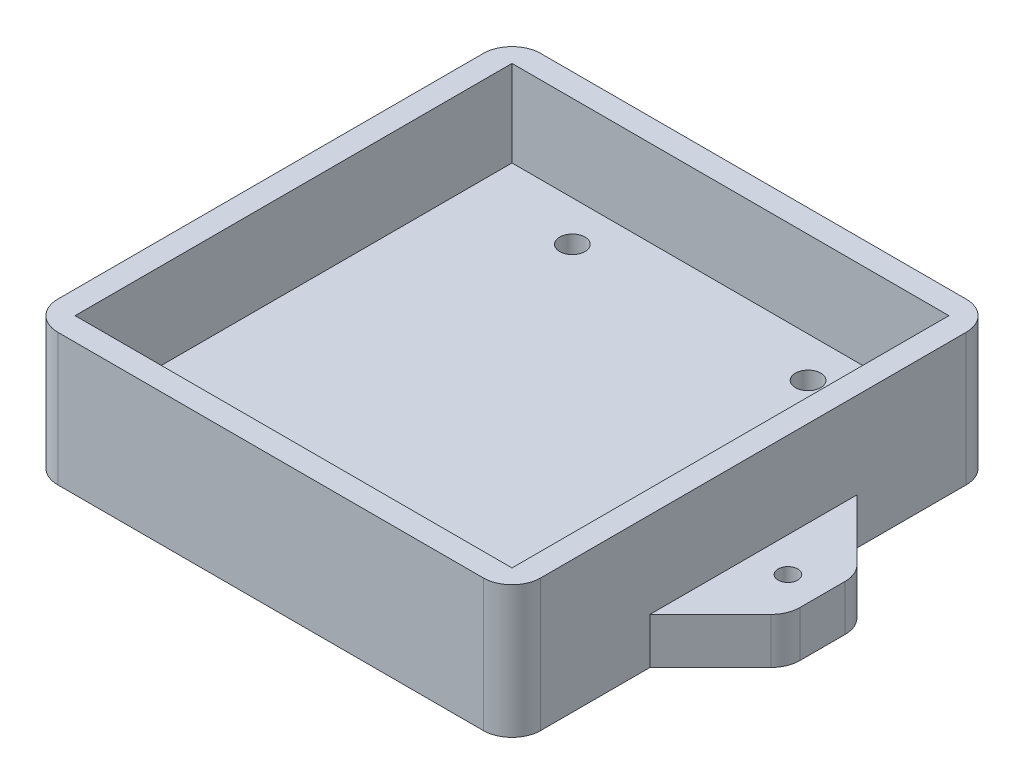
ISO-10303-21;
HEADER;
FILE_DESCRIPTION(('STEP AP214'),'2;1');
FILE_NAME('part.step','',(''),(''),'','','');
FILE_SCHEMA(('AUTOMOTIVE_DESIGN { 1 0 10303 214 1 1 1 1 }'));
ENDSEC;
DATA;
#1=APPLICATION_CONTEXT('core data for automotive mechanical design processes');
#2=APPLICATION_PROTOCOL_DEFINITION('international standard','automotive_design',2000,#1);
#3=PRODUCT_CONTEXT('',#1,'mechanical');
#4=PRODUCT('Part','Part','',(#3));
#5=PRODUCT_RELATED_PRODUCT_CATEGORY('part','',(#4));
#6=PRODUCT_DEFINITION_FORMATION('','',#4);
#7=PRODUCT_DEFINITION_CONTEXT('part definition',#1,'design');
#8=PRODUCT_DEFINITION('design','',#6,#7);
#9=PRODUCT_DEFINITION_SHAPE('','',#8);
#10=(LENGTH_UNIT() NAMED_UNIT(*) SI_UNIT(.MILLI.,.METRE.));
#11=(NAMED_UNIT(*) PLANE_ANGLE_UNIT() SI_UNIT($,.RADIAN.));
#12=(NAMED_UNIT(*) SI_UNIT($,.STERADIAN.) SOLID_ANGLE_UNIT());
#13=UNCERTAINTY_MEASURE_WITH_UNIT(LENGTH_MEASURE(1.E-05),#10,'distance_accuracy_value','');
#14=(GEOMETRIC_REPRESENTATION_CONTEXT(3) GLOBAL_UNCERTAINTY_ASSIGNED_CONTEXT((#13)) GLOBAL_UNIT_ASSIGNED_CONTEXT((#10,
#11,#12)) REPRESENTATION_CONTEXT('',''));
#15=CARTESIAN_POINT('',(0.,0.,0.));
#16=DIRECTION('',(0.,0.,1.));
#17=DIRECTION('',(1.,0.,0.));
#18=AXIS2_PLACEMENT_3D('',#15,#16,#17);
#19=CARTESIAN_POINT('',(-20.5,-8.,31.));
#20=DIRECTION('',(0.,1.,0.));
#21=DIRECTION('',(0.,0.,1.));
#22=AXIS2_PLACEMENT_3D('',#19,#20,#21);
#23=CYLINDRICAL_SURFACE('',#22,2.2);
#24=CARTESIAN_POINT('',(-20.5,0.,31.));
#25=DIRECTION('',(0.,1.,0.));
#26=DIRECTION('',(0.,0.,1.));
#27=AXIS2_PLACEMENT_3D('',#24,#25,#26);
#28=CIRCLE('',#27,2.2);
#29=CARTESIAN_POINT('',(-20.5,0.,33.2));
#30=VERTEX_POINT('',#29);
#31=EDGE_CURVE('E374',#30,#30,#28,.T.);
#32=ORIENTED_EDGE('',*,*,#31,.T.);
#33=EDGE_LOOP('',(#32));
#34=FACE_BOUND('',#33,.T.);
#35=CARTESIAN_POINT('',(-20.5,-3.5,31.));
#36=DIRECTION('',(0.,-1.,0.));
#37=DIRECTION('',(0.,0.,-1.));
#38=AXIS2_PLACEMENT_3D('',#35,#36,#37);
#39=CIRCLE('',#38,2.2);
#40=CARTESIAN_POINT('',(-20.5,-3.5,28.8));
#41=VERTEX_POINT('',#40);
#42=EDGE_CURVE('E265',#41,#41,#39,.F.);
#43=ORIENTED_EDGE('',*,*,#42,.F.);
#44=EDGE_LOOP('',(#43));
#45=FACE_BOUND('',#44,.T.);
#46=ADVANCED_FACE('F47',(#34,#45),#23,.F.);
#47=CARTESIAN_POINT('',(20.5,-8.,-31.));
#48=DIRECTION('',(0.,1.,0.));
#49=DIRECTION('',(0.,0.,1.));
#50=AXIS2_PLACEMENT_3D('',#47,#48,#49);
#51=CYLINDRICAL_SURFACE('',#50,2.2);
#52=CARTESIAN_POINT('',(20.5,0.,-31.));
#53=DIRECTION('',(0.,1.,0.));
#54=DIRECTION('',(0.,0.,1.));
#55=AXIS2_PLACEMENT_3D('',#52,#53,#54);
#56=CIRCLE('',#55,2.2);
#57=CARTESIAN_POINT('',(20.5,0.,-28.8));
#58=VERTEX_POINT('',#57);
#59=EDGE_CURVE('E370',#58,#58,#56,.T.);
#60=ORIENTED_EDGE('',*,*,#59,.T.);
#61=EDGE_LOOP('',(#60));
#62=FACE_BOUND('',#61,.T.);
#63=CARTESIAN_POINT('',(20.5,-3.5,-31.));
#64=DIRECTION('',(0.,-1.,0.));
#65=DIRECTION('',(0.,0.,-1.));
#66=AXIS2_PLACEMENT_3D('',#63,#64,#65);
#67=CIRCLE('',#66,2.2);
#68=CARTESIAN_POINT('',(20.5,-3.5,-33.2));
#69=VERTEX_POINT('',#68);
#70=EDGE_CURVE('E404',#69,#69,#67,.F.);
#71=ORIENTED_EDGE('',*,*,#70,.F.);
#72=EDGE_LOOP('',(#71));
#73=FACE_BOUND('',#72,.T.);
#74=ADVANCED_FACE('F612',(#62,#73),#51,.F.);
#75=CARTESIAN_POINT('',(-20.5,-8.,-31.));
#76=DIRECTION('',(0.,1.,0.));
#77=DIRECTION('',(0.,0.,1.));
#78=AXIS2_PLACEMENT_3D('',#75,#76,#77);
#79=CYLINDRICAL_SURFACE('',#78,2.2);
#80=CARTESIAN_POINT('',(-20.5,0.,-31.));
#81=DIRECTION('',(0.,1.,0.));
#82=DIRECTION('',(0.,0.,1.));
#83=AXIS2_PLACEMENT_3D('',#80,#81,#82);
#84=CIRCLE('',#83,2.2);
#85=CARTESIAN_POINT('',(-20.5,0.,-28.8));
#86=VERTEX_POINT('',#85);
#87=EDGE_CURVE('E366',#86,#86,#84,.T.);
#88=ORIENTED_EDGE('',*,*,#87,.T.);
#89=EDGE_LOOP('',(#88));
#90=FACE_BOUND('',#89,.T.);
#91=CARTESIAN_POINT('',(-20.5,-3.5,-31.));
#92=DIRECTION('',(0.,-1.,0.));
#93=DIRECTION('',(0.,0.,-1.));
#94=AXIS2_PLACEMENT_3D('',#91,#92,#93);
#95=CIRCLE('',#94,2.2);
#96=CARTESIAN_POINT('',(-20.5,-3.5,-33.2));
#97=VERTEX_POINT('',#96);
#98=EDGE_CURVE('E399',#97,#97,#95,.F.);
#99=ORIENTED_EDGE('',*,*,#98,.F.);
#100=EDGE_LOOP('',(#99));
#101=FACE_BOUND('',#100,.T.);
#102=ADVANCED_FACE('F619',(#90,#101),#79,.F.);
#103=CARTESIAN_POINT('',(20.5,-8.,31.));
#104=DIRECTION('',(0.,1.,0.));
#105=DIRECTION('',(0.,0.,1.));
#106=AXIS2_PLACEMENT_3D('',#103,#104,#105);
#107=CYLINDRICAL_SURFACE('',#106,2.2);
#108=CARTESIAN_POINT('',(20.5,0.,31.));
#109=DIRECTION('',(0.,1.,0.));
#110=DIRECTION('',(0.,0.,1.));
#111=AXIS2_PLACEMENT_3D('',#108,#109,#110);
#112=CIRCLE('',#111,2.2);
#113=CARTESIAN_POINT('',(20.5,0.,33.2));
#114=VERTEX_POINT('',#113);
#115=EDGE_CURVE('E296',#114,#114,#112,.T.);
#116=ORIENTED_EDGE('',*,*,#115,.T.);
#117=EDGE_LOOP('',(#116));
#118=FACE_BOUND('',#117,.T.);
#119=CARTESIAN_POINT('',(20.5,-3.5,31.));
#120=DIRECTION('',(0.,-1.,0.));
#121=DIRECTION('',(0.,0.,-1.));
#122=AXIS2_PLACEMENT_3D('',#119,#120,#121);
#123=CIRCLE('',#122,2.2);
#124=CARTESIAN_POINT('',(20.5,-3.5,28.8));
#125=VERTEX_POINT('',#124);
#126=EDGE_CURVE('E395',#125,#125,#123,.F.);
#127=ORIENTED_EDGE('',*,*,#126,.F.);
#128=EDGE_LOOP('',(#127));
#129=FACE_BOUND('',#128,.T.);
#130=ADVANCED_FACE('F624',(#118,#129),#107,.F.);
#131=CARTESIAN_POINT('',(0.,0.,0.));
#132=DIRECTION('',(0.,1.,0.));
#133=DIRECTION('',(0.,0.,1.));
#134=AXIS2_PLACEMENT_3D('',#131,#132,#133);
#135=PLANE('',#134);
#136=ORIENTED_EDGE('',*,*,#87,.F.);
#137=EDGE_LOOP('',(#136));
#138=FACE_BOUND('',#137,.T.);
#139=ORIENTED_EDGE('',*,*,#59,.F.);
#140=EDGE_LOOP('',(#139));
#141=FACE_BOUND('',#140,.T.);
#142=ORIENTED_EDGE('',*,*,#31,.F.);
#143=EDGE_LOOP('',(#142));
#144=FACE_BOUND('',#143,.T.);
#145=ORIENTED_EDGE('',*,*,#115,.F.);
#146=EDGE_LOOP('',(#145));
#147=FACE_BOUND('',#146,.T.);
#148=DIRECTION('',(-1.,0.,0.));
#149=VECTOR('',#148,1.);
#150=CARTESIAN_POINT('',(0.,0.,-38.));
#151=LINE('',#150,#149);
#152=CARTESIAN_POINT('',(38.,0.,-38.));
#153=VERTEX_POINT('',#152);
#154=CARTESIAN_POINT('',(-38.,0.,-38.));
#155=VERTEX_POINT('',#154);
#156=EDGE_CURVE('E264',#153,#155,#151,.T.);
#157=ORIENTED_EDGE('',*,*,#156,.T.);
#158=DIRECTION('',(0.,0.,1.));
#159=VECTOR('',#158,1.);
#160=CARTESIAN_POINT('',(-38.,0.,0.));
#161=LINE('',#160,#159);
#162=CARTESIAN_POINT('',(-38.,0.,38.));
#163=VERTEX_POINT('',#162);
#164=EDGE_CURVE('E214',#155,#163,#161,.T.);
#165=ORIENTED_EDGE('',*,*,#164,.T.);
#166=DIRECTION('',(-1.,0.,0.));
#167=VECTOR('',#166,1.);
#168=CARTESIAN_POINT('',(0.,0.,38.));
#169=LINE('',#168,#167);
#170=CARTESIAN_POINT('',(38.,0.,38.));
#171=VERTEX_POINT('',#170);
#172=EDGE_CURVE('E232',#171,#163,#169,.T.);
#173=ORIENTED_EDGE('',*,*,#172,.F.);
#174=DIRECTION('',(0.,0.,1.));
#175=VECTOR('',#174,1.);
#176=CARTESIAN_POINT('',(38.,0.,0.));
#177=LINE('',#176,#175);
#178=EDGE_CURVE('E268',#153,#171,#177,.T.);
#179=ORIENTED_EDGE('',*,*,#178,.F.);
#180=EDGE_LOOP('',(#157,#165,#173,#179));
#181=FACE_BOUND('',#180,.T.);
#182=ADVANCED_FACE('F660',(#138,#141,#144,#147,#181),#135,.T.);
#183=CARTESIAN_POINT('',(48.,0.,0.));
#184=DIRECTION('',(0.,1.,0.));
#185=DIRECTION('',(0.,0.,1.));
#186=AXIS2_PLACEMENT_3D('',#183,#184,#185);
#187=CIRCLE('',#186,1.7);
#188=CARTESIAN_POINT('',(48.,0.,1.7));
#189=VERTEX_POINT('',#188);
#190=EDGE_CURVE('E362',#189,#189,#187,.F.);
#191=ORIENTED_EDGE('',*,*,#190,.T.);
#192=EDGE_LOOP('',(#191));
#193=FACE_BOUND('',#192,.T.);
#194=DIRECTION('',(-0.707106781186552,0.,0.707106781186543));
#195=VECTOR('',#194,1.);
#196=CARTESIAN_POINT('',(29.9999999999997,0.,30.));
#197=LINE('',#196,#195);
#198=CARTESIAN_POINT('',(52.5355339059327,0.,7.46446609406726));
#199=VERTEX_POINT('',#198);
#200=CARTESIAN_POINT('',(42.,0.,17.9999999999999));
#201=VERTEX_POINT('',#200);
#202=EDGE_CURVE('E220',#199,#201,#197,.T.);
#203=ORIENTED_EDGE('',*,*,#202,.F.);
#204=CARTESIAN_POINT('',(49.,0.,3.92893218813451));
#205=DIRECTION('',(0.,1.,0.));
#206=DIRECTION('',(0.,0.,1.));
#207=AXIS2_PLACEMENT_3D('',#204,#205,#206);
#208=CIRCLE('',#207,5.);
#209=CARTESIAN_POINT('',(54.,0.,3.92893218813451));
#210=VERTEX_POINT('',#209);
#211=EDGE_CURVE('E467',#199,#210,#208,.T.);
#212=ORIENTED_EDGE('',*,*,#211,.T.);
#213=DIRECTION('',(0.,0.,1.));
#214=VECTOR('',#213,1.);
#215=CARTESIAN_POINT('',(54.,0.,0.));
#216=LINE('',#215,#214);
#217=CARTESIAN_POINT('',(54.,0.,-3.9289321881345));
#218=VERTEX_POINT('',#217);
#219=EDGE_CURVE('E342',#218,#210,#216,.T.);
#220=ORIENTED_EDGE('',*,*,#219,.F.);
#221=CARTESIAN_POINT('',(49.,0.,-3.9289321881345));
#222=DIRECTION('',(0.,1.,0.));
#223=DIRECTION('',(0.,0.,1.));
#224=AXIS2_PLACEMENT_3D('',#221,#222,#223);
#225=CIRCLE('',#224,5.);
#226=CARTESIAN_POINT('',(52.5355339059327,0.,-7.46446609406726));
#227=VERTEX_POINT('',#226);
#228=EDGE_CURVE('E464',#218,#227,#225,.T.);
#229=ORIENTED_EDGE('',*,*,#228,.T.);
#230=DIRECTION('',(-0.707106781186551,0.,-0.707106781186544));
#231=VECTOR('',#230,1.);
#232=CARTESIAN_POINT('',(29.9999999999997,0.,-30.));
#233=LINE('',#232,#231);
#234=CARTESIAN_POINT('',(42.,0.,-17.9999999999999));
#235=VERTEX_POINT('',#234);
#236=EDGE_CURVE('E346',#227,#235,#233,.T.);
#237=ORIENTED_EDGE('',*,*,#236,.T.);
#238=DIRECTION('',(0.,0.,1.));
#239=VECTOR('',#238,1.);
#240=CARTESIAN_POINT('',(42.,0.,0.));
#241=LINE('',#240,#239);
#242=EDGE_CURVE('E274',#235,#201,#241,.T.);
#243=ORIENTED_EDGE('',*,*,#242,.T.);
#244=EDGE_LOOP('',(#203,#212,#220,#229,#237,#243));
#245=FACE_BOUND('',#244,.T.);
#246=ADVANCED_FACE('F572',(#193,#245),#135,.T.);
#247=CARTESIAN_POINT('',(29.9999999999997,-8.,30.));
#248=DIRECTION('',(-0.707106781186543,0.,-0.707106781186552));
#249=DIRECTION('',(-0.707106781186552,0.,0.707106781186543));
#250=AXIS2_PLACEMENT_3D('',#247,#248,#249);
#251=PLANE('',#250);
#252=DIRECTION('',(-0.707106781186552,0.,0.707106781186543));
#253=VECTOR('',#252,1.);
#254=CARTESIAN_POINT('',(29.9999999999997,-8.,30.));
#255=LINE('',#254,#253);
#256=CARTESIAN_POINT('',(52.5355339059327,-8.,7.46446609406726));
#257=VERTEX_POINT('',#256);
#258=CARTESIAN_POINT('',(42.,-8.,17.9999999999999));
#259=VERTEX_POINT('',#258);
#260=EDGE_CURVE('E292',#257,#259,#255,.T.);
#261=ORIENTED_EDGE('',*,*,#260,.F.);
#262=DIRECTION('',(0.,1.,0.));
#263=VECTOR('',#262,1.);
#264=CARTESIAN_POINT('',(52.5355339059327,-8.,7.46446609406727));
#265=LINE('',#264,#263);
#266=EDGE_CURVE('E460',#257,#199,#265,.T.);
#267=ORIENTED_EDGE('',*,*,#266,.T.);
#268=ORIENTED_EDGE('',*,*,#202,.T.);
#269=DIRECTION('',(0.,1.,0.));
#270=VECTOR('',#269,1.);
#271=CARTESIAN_POINT('',(42.,-8.,17.9999999999999));
#272=LINE('',#271,#270);
#273=EDGE_CURVE('E283',#259,#201,#272,.T.);
#274=ORIENTED_EDGE('',*,*,#273,.F.);
#275=EDGE_LOOP('',(#261,#267,#268,#274));
#276=FACE_BOUND('',#275,.T.);
#277=ADVANCED_FACE('F580',(#276),#251,.F.);
#278=CARTESIAN_POINT('',(42.,-8.,0.));
#279=DIRECTION('',(-1.,0.,0.));
#280=DIRECTION('',(0.,0.,1.));
#281=AXIS2_PLACEMENT_3D('',#278,#279,#280);
#282=PLANE('',#281);
#283=DIRECTION('',(0.,0.,1.));
#284=VECTOR('',#283,1.);
#285=CARTESIAN_POINT('',(42.,15.,0.));
#286=LINE('',#285,#284);
#287=CARTESIAN_POINT('',(42.,15.,-37.));
#288=VERTEX_POINT('',#287);
#289=CARTESIAN_POINT('',(42.,15.,37.));
#290=VERTEX_POINT('',#289);
#291=EDGE_CURVE('E245',#288,#290,#286,.T.);
#292=ORIENTED_EDGE('',*,*,#291,.T.);
#293=DIRECTION('',(0.,1.,0.));
#294=VECTOR('',#293,1.);
#295=CARTESIAN_POINT('',(42.,-8.,37.));
#296=LINE('',#295,#294);
#297=CARTESIAN_POINT('',(42.,-8.,37.));
#298=VERTEX_POINT('',#297);
#299=EDGE_CURVE('E433',#290,#298,#296,.F.);
#300=ORIENTED_EDGE('',*,*,#299,.T.);
#301=DIRECTION('',(0.,0.,1.));
#302=VECTOR('',#301,1.);
#303=CARTESIAN_POINT('',(42.,-8.,0.));
#304=LINE('',#303,#302);
#305=EDGE_CURVE('E308',#259,#298,#304,.T.);
#306=ORIENTED_EDGE('',*,*,#305,.F.);
#307=ORIENTED_EDGE('',*,*,#273,.T.);
#308=ORIENTED_EDGE('',*,*,#242,.F.);
#309=DIRECTION('',(0.,1.,0.));
#310=VECTOR('',#309,1.);
#311=CARTESIAN_POINT('',(42.,-8.,-17.9999999999999));
#312=LINE('',#311,#310);
#313=CARTESIAN_POINT('',(42.,-8.,-17.9999999999999));
#314=VERTEX_POINT('',#313);
#315=EDGE_CURVE('E339',#314,#235,#312,.T.);
#316=ORIENTED_EDGE('',*,*,#315,.F.);
#317=CARTESIAN_POINT('',(42.,-8.,-37.));
#318=VERTEX_POINT('',#317);
#319=EDGE_CURVE('E303',#318,#314,#304,.T.);
#320=ORIENTED_EDGE('',*,*,#319,.F.);
#321=DIRECTION('',(0.,1.,0.));
#322=VECTOR('',#321,1.);
#323=CARTESIAN_POINT('',(42.,15.,-37.));
#324=LINE('',#323,#322);
#325=EDGE_CURVE('E429',#318,#288,#324,.T.);
#326=ORIENTED_EDGE('',*,*,#325,.T.);
#327=EDGE_LOOP('',(#292,#300,#306,#307,#308,#316,#320,#326));
#328=FACE_BOUND('',#327,.T.);
#329=ADVANCED_FACE('F554',(#328),#282,.F.);
#330=CARTESIAN_POINT('',(0.,-8.,42.));
#331=DIRECTION('',(0.,0.,-1.));
#332=DIRECTION('',(-1.,0.,0.));
#333=AXIS2_PLACEMENT_3D('',#330,#331,#332);
#334=PLANE('',#333);
#335=DIRECTION('',(-1.,0.,0.));
#336=VECTOR('',#335,1.);
#337=CARTESIAN_POINT('',(0.,-8.,42.));
#338=LINE('',#337,#336);
#339=CARTESIAN_POINT('',(37.,-8.,42.));
#340=VERTEX_POINT('',#339);
#341=CARTESIAN_POINT('',(-37.,-8.,42.));
#342=VERTEX_POINT('',#341);
#343=EDGE_CURVE('E327',#340,#342,#338,.T.);
#344=ORIENTED_EDGE('',*,*,#343,.F.);
#345=DIRECTION('',(0.,1.,0.));
#346=VECTOR('',#345,1.);
#347=CARTESIAN_POINT('',(37.,-8.,42.));
#348=LINE('',#347,#346);
#349=CARTESIAN_POINT('',(37.,15.,42.));
#350=VERTEX_POINT('',#349);
#351=EDGE_CURVE('E413',#340,#350,#348,.T.);
#352=ORIENTED_EDGE('',*,*,#351,.T.);
#353=DIRECTION('',(-1.,0.,0.));
#354=VECTOR('',#353,1.);
#355=CARTESIAN_POINT('',(0.,15.,42.));
#356=LINE('',#355,#354);
#357=CARTESIAN_POINT('',(-37.,15.,42.));
#358=VERTEX_POINT('',#357);
#359=EDGE_CURVE('E257',#350,#358,#356,.T.);
#360=ORIENTED_EDGE('',*,*,#359,.T.);
#361=DIRECTION('',(0.,1.,0.));
#362=VECTOR('',#361,1.);
#363=CARTESIAN_POINT('',(-37.,-8.,42.));
#364=LINE('',#363,#362);
#365=EDGE_CURVE('E278',#358,#342,#364,.F.);
#366=ORIENTED_EDGE('',*,*,#365,.T.);
#367=EDGE_LOOP('',(#344,#352,#360,#366));
#368=FACE_BOUND('',#367,.T.);
#369=ADVANCED_FACE('F594',(#368),#334,.F.);
#370=CARTESIAN_POINT('',(-42.,-8.,0.));
#371=DIRECTION('',(-1.,0.,0.));
#372=DIRECTION('',(0.,0.,1.));
#373=AXIS2_PLACEMENT_3D('',#370,#371,#372);
#374=PLANE('',#373);
#375=DIRECTION('',(0.,0.,1.));
#376=VECTOR('',#375,1.);
#377=CARTESIAN_POINT('',(-42.,15.,0.));
#378=LINE('',#377,#376);
#379=CARTESIAN_POINT('',(-42.,15.,-37.));
#380=VERTEX_POINT('',#379);
#381=CARTESIAN_POINT('',(-42.,15.,37.));
#382=VERTEX_POINT('',#381);
#383=EDGE_CURVE('E253',#380,#382,#378,.T.);
#384=ORIENTED_EDGE('',*,*,#383,.F.);
#385=DIRECTION('',(0.,1.,0.));
#386=VECTOR('',#385,1.);
#387=CARTESIAN_POINT('',(-42.,-8.,-37.));
#388=LINE('',#387,#386);
#389=CARTESIAN_POINT('',(-42.,-8.,-37.));
#390=VERTEX_POINT('',#389);
#391=EDGE_CURVE('E491',#380,#390,#388,.F.);
#392=ORIENTED_EDGE('',*,*,#391,.T.);
#393=DIRECTION('',(0.,0.,1.));
#394=VECTOR('',#393,1.);
#395=CARTESIAN_POINT('',(-42.,-8.,0.));
#396=LINE('',#395,#394);
#397=CARTESIAN_POINT('',(-42.,-8.,-17.9999999999999));
#398=VERTEX_POINT('',#397);
#399=EDGE_CURVE('E312',#390,#398,#396,.T.);
#400=ORIENTED_EDGE('',*,*,#399,.T.);
#401=DIRECTION('',(0.,1.,0.));
#402=VECTOR('',#401,1.);
#403=CARTESIAN_POINT('',(-42.,-8.,-17.9999999999999));
#404=LINE('',#403,#402);
#405=CARTESIAN_POINT('',(-42.,0.,-17.9999999999999));
#406=VERTEX_POINT('',#405);
#407=EDGE_CURVE('E388',#398,#406,#404,.T.);
#408=ORIENTED_EDGE('',*,*,#407,.T.);
#409=DIRECTION('',(0.,0.,1.));
#410=VECTOR('',#409,1.);
#411=CARTESIAN_POINT('',(-42.,0.,0.));
#412=LINE('',#411,#410);
#413=CARTESIAN_POINT('',(-42.,0.,17.9999999999999));
#414=VERTEX_POINT('',#413);
#415=EDGE_CURVE('E279',#406,#414,#412,.T.);
#416=ORIENTED_EDGE('',*,*,#415,.T.);
#417=DIRECTION('',(0.,1.,0.));
#418=VECTOR('',#417,1.);
#419=CARTESIAN_POINT('',(-42.,-8.,17.9999999999999));
#420=LINE('',#419,#418);
#421=CARTESIAN_POINT('',(-42.,-8.,17.9999999999999));
#422=VERTEX_POINT('',#421);
#423=EDGE_CURVE('E384',#422,#414,#420,.T.);
#424=ORIENTED_EDGE('',*,*,#423,.F.);
#425=CARTESIAN_POINT('',(-42.,-8.,37.));
#426=VERTEX_POINT('',#425);
#427=EDGE_CURVE('E316',#422,#426,#396,.T.);
#428=ORIENTED_EDGE('',*,*,#427,.T.);
#429=DIRECTION('',(0.,1.,0.));
#430=VECTOR('',#429,1.);
#431=CARTESIAN_POINT('',(-42.,15.,37.));
#432=LINE('',#431,#430);
#433=EDGE_CURVE('E487',#426,#382,#432,.T.);
#434=ORIENTED_EDGE('',*,*,#433,.T.);
#435=EDGE_LOOP('',(#384,#392,#400,#408,#416,#424,#428,#434));
#436=FACE_BOUND('',#435,.T.);
#437=ADVANCED_FACE('F587',(#436),#374,.T.);
#438=CARTESIAN_POINT('',(-29.9999999999997,-8.,30.));
#439=DIRECTION('',(-0.707106781186543,0.,0.707106781186552));
#440=DIRECTION('',(0.707106781186552,0.,0.707106781186543));
#441=AXIS2_PLACEMENT_3D('',#438,#439,#440);
#442=PLANE('',#441);
#443=DIRECTION('',(0.707106781186552,0.,0.707106781186543));
#444=VECTOR('',#443,1.);
#445=CARTESIAN_POINT('',(-29.9999999999997,0.,30.));
#446=LINE('',#445,#444);
#447=CARTESIAN_POINT('',(-52.5355339059327,0.,7.46446609406727));
#448=VERTEX_POINT('',#447);
#449=EDGE_CURVE('E355',#448,#414,#446,.T.);
#450=ORIENTED_EDGE('',*,*,#449,.F.);
#451=DIRECTION('',(0.,1.,0.));
#452=VECTOR('',#451,1.);
#453=CARTESIAN_POINT('',(-52.5355339059327,-8.,7.46446609406727));
#454=LINE('',#453,#452);
#455=CARTESIAN_POINT('',(-52.5355339059327,-8.,7.46446609406727));
#456=VERTEX_POINT('',#455);
#457=EDGE_CURVE('E56',#448,#456,#454,.F.);
#458=ORIENTED_EDGE('',*,*,#457,.T.);
#459=DIRECTION('',(0.707106781186552,0.,0.707106781186543));
#460=VECTOR('',#459,1.);
#461=CARTESIAN_POINT('',(-29.9999999999997,-8.,30.));
#462=LINE('',#461,#460);
#463=EDGE_CURVE('E324',#456,#422,#462,.T.);
#464=ORIENTED_EDGE('',*,*,#463,.T.);
#465=ORIENTED_EDGE('',*,*,#423,.T.);
#466=EDGE_LOOP('',(#450,#458,#464,#465));
#467=FACE_BOUND('',#466,.T.);
#468=ADVANCED_FACE('F508',(#467),#442,.T.);
#469=CARTESIAN_POINT('',(-54.,-8.,0.));
#470=DIRECTION('',(-1.,0.,0.));
#471=DIRECTION('',(0.,0.,1.));
#472=AXIS2_PLACEMENT_3D('',#469,#470,#471);
#473=PLANE('',#472);
#474=DIRECTION('',(0.,0.,1.));
#475=VECTOR('',#474,1.);
#476=CARTESIAN_POINT('',(-54.,-8.,0.));
#477=LINE('',#476,#475);
#478=CARTESIAN_POINT('',(-54.,-8.,-3.9289321881345));
#479=VERTEX_POINT('',#478);
#480=CARTESIAN_POINT('',(-54.,-8.,3.92893218813451));
#481=VERTEX_POINT('',#480);
#482=EDGE_CURVE('E320',#479,#481,#477,.T.);
#483=ORIENTED_EDGE('',*,*,#482,.T.);
#484=DIRECTION('',(0.,1.,0.));
#485=VECTOR('',#484,1.);
#486=CARTESIAN_POINT('',(-54.,-8.,3.92893218813451));
#487=LINE('',#486,#485);
#488=CARTESIAN_POINT('',(-54.,0.,3.92893218813451));
#489=VERTEX_POINT('',#488);
#490=EDGE_CURVE('E497',#481,#489,#487,.T.);
#491=ORIENTED_EDGE('',*,*,#490,.T.);
#492=DIRECTION('',(0.,0.,1.));
#493=VECTOR('',#492,1.);
#494=CARTESIAN_POINT('',(-54.,0.,0.));
#495=LINE('',#494,#493);
#496=CARTESIAN_POINT('',(-54.,0.,-3.9289321881345));
#497=VERTEX_POINT('',#496);
#498=EDGE_CURVE('E352',#497,#489,#495,.T.);
#499=ORIENTED_EDGE('',*,*,#498,.F.);
#500=DIRECTION('',(0.,1.,0.));
#501=VECTOR('',#500,1.);
#502=CARTESIAN_POINT('',(-54.,-8.,-3.9289321881345));
#503=LINE('',#502,#501);
#504=EDGE_CURVE('E494',#497,#479,#503,.F.);
#505=ORIENTED_EDGE('',*,*,#504,.T.);
#506=EDGE_LOOP('',(#483,#491,#499,#505));
#507=FACE_BOUND('',#506,.T.);
#508=ADVANCED_FACE('F523',(#507),#473,.T.);
#509=CARTESIAN_POINT('',(-29.9999999999997,-8.,-30.));
#510=DIRECTION('',(0.707106781186544,0.,0.707106781186551));
#511=DIRECTION('',(0.707106781186551,0.,-0.707106781186544));
#512=AXIS2_PLACEMENT_3D('',#509,#510,#511);
#513=PLANE('',#512);
#514=DIRECTION('',(0.707106781186551,0.,-0.707106781186544));
#515=VECTOR('',#514,1.);
#516=CARTESIAN_POINT('',(-29.9999999999997,-8.,-30.));
#517=LINE('',#516,#515);
#518=CARTESIAN_POINT('',(-52.5355339059327,-8.,-7.46446609406726));
#519=VERTEX_POINT('',#518);
#520=EDGE_CURVE('E315',#519,#398,#517,.T.);
#521=ORIENTED_EDGE('',*,*,#520,.F.);
#522=DIRECTION('',(0.,1.,0.));
#523=VECTOR('',#522,1.);
#524=CARTESIAN_POINT('',(-52.5355339059327,0.,-7.46446609406726));
#525=LINE('',#524,#523);
#526=CARTESIAN_POINT('',(-52.5355339059327,0.,-7.46446609406726));
#527=VERTEX_POINT('',#526);
#528=EDGE_CURVE('E11',#519,#527,#525,.T.);
#529=ORIENTED_EDGE('',*,*,#528,.T.);
#530=DIRECTION('',(0.707106781186551,0.,-0.707106781186544));
#531=VECTOR('',#530,1.);
#532=CARTESIAN_POINT('',(-29.9999999999997,0.,-30.));
#533=LINE('',#532,#531);
#534=EDGE_CURVE('E349',#527,#406,#533,.T.);
#535=ORIENTED_EDGE('',*,*,#534,.T.);
#536=ORIENTED_EDGE('',*,*,#407,.F.);
#537=EDGE_LOOP('',(#521,#529,#535,#536));
#538=FACE_BOUND('',#537,.T.);
#539=ADVANCED_FACE('F531',(#538),#513,.F.);
#540=CARTESIAN_POINT('',(0.,-8.,-42.));
#541=DIRECTION('',(0.,0.,-1.));
#542=DIRECTION('',(-1.,0.,0.));
#543=AXIS2_PLACEMENT_3D('',#540,#541,#542);
#544=PLANE('',#543);
#545=DIRECTION('',(-1.,0.,0.));
#546=VECTOR('',#545,1.);
#547=CARTESIAN_POINT('',(0.,15.,-42.));
#548=LINE('',#547,#546);
#549=CARTESIAN_POINT('',(37.,15.,-42.));
#550=VERTEX_POINT('',#549);
#551=CARTESIAN_POINT('',(-37.,15.,-42.));
#552=VERTEX_POINT('',#551);
#553=EDGE_CURVE('E249',#550,#552,#548,.T.);
#554=ORIENTED_EDGE('',*,*,#553,.F.);
#555=DIRECTION('',(0.,1.,0.));
#556=VECTOR('',#555,1.);
#557=CARTESIAN_POINT('',(37.,-8.,-42.));
#558=LINE('',#557,#556);
#559=CARTESIAN_POINT('',(37.,-8.,-42.));
#560=VERTEX_POINT('',#559);
#561=EDGE_CURVE('E484',#550,#560,#558,.F.);
#562=ORIENTED_EDGE('',*,*,#561,.T.);
#563=DIRECTION('',(-1.,0.,0.));
#564=VECTOR('',#563,1.);
#565=CARTESIAN_POINT('',(0.,-8.,-42.));
#566=LINE('',#565,#564);
#567=CARTESIAN_POINT('',(-37.,-8.,-42.));
#568=VERTEX_POINT('',#567);
#569=EDGE_CURVE('E307',#560,#568,#566,.T.);
#570=ORIENTED_EDGE('',*,*,#569,.T.);
#571=DIRECTION('',(0.,1.,0.));
#572=VECTOR('',#571,1.);
#573=CARTESIAN_POINT('',(-37.,-8.,-42.));
#574=LINE('',#573,#572);
#575=EDGE_CURVE('E480',#568,#552,#574,.T.);
#576=ORIENTED_EDGE('',*,*,#575,.T.);
#577=EDGE_LOOP('',(#554,#562,#570,#576));
#578=FACE_BOUND('',#577,.T.);
#579=ADVANCED_FACE('F543',(#578),#544,.T.);
#580=CARTESIAN_POINT('',(29.9999999999997,-8.,-30.));
#581=DIRECTION('',(0.707106781186544,0.,-0.707106781186551));
#582=DIRECTION('',(-0.707106781186551,0.,-0.707106781186544));
#583=AXIS2_PLACEMENT_3D('',#580,#581,#582);
#584=PLANE('',#583);
#585=ORIENTED_EDGE('',*,*,#236,.F.);
#586=DIRECTION('',(0.,1.,0.));
#587=VECTOR('',#586,1.);
#588=CARTESIAN_POINT('',(52.5355339059327,-8.,-7.46446609406726));
#589=LINE('',#588,#587);
#590=CARTESIAN_POINT('',(52.5355339059327,-8.,-7.46446609406726));
#591=VERTEX_POINT('',#590);
#592=EDGE_CURVE('E477',#227,#591,#589,.F.);
#593=ORIENTED_EDGE('',*,*,#592,.T.);
#594=DIRECTION('',(-0.707106781186551,0.,-0.707106781186544));
#595=VECTOR('',#594,1.);
#596=CARTESIAN_POINT('',(29.9999999999997,-8.,-30.));
#597=LINE('',#596,#595);
#598=EDGE_CURVE('E300',#591,#314,#597,.T.);
#599=ORIENTED_EDGE('',*,*,#598,.T.);
#600=ORIENTED_EDGE('',*,*,#315,.T.);
#601=EDGE_LOOP('',(#585,#593,#599,#600));
#602=FACE_BOUND('',#601,.T.);
#603=ADVANCED_FACE('F634',(#602),#584,.T.);
#604=CARTESIAN_POINT('',(48.,-8.,0.));
#605=DIRECTION('',(0.,1.,0.));
#606=DIRECTION('',(0.,0.,1.));
#607=AXIS2_PLACEMENT_3D('',#604,#605,#606);
#608=CYLINDRICAL_SURFACE('',#607,1.7);
#609=CARTESIAN_POINT('',(48.,-8.,0.));
#610=DIRECTION('',(0.,1.,0.));
#611=DIRECTION('',(0.,0.,1.));
#612=AXIS2_PLACEMENT_3D('',#609,#610,#611);
#613=CIRCLE('',#612,1.7);
#614=CARTESIAN_POINT('',(48.,-8.,1.7));
#615=VERTEX_POINT('',#614);
#616=EDGE_CURVE('E335',#615,#615,#613,.F.);
#617=ORIENTED_EDGE('',*,*,#616,.T.);
#618=EDGE_LOOP('',(#617));
#619=FACE_BOUND('',#618,.T.);
#620=ORIENTED_EDGE('',*,*,#190,.F.);
#621=EDGE_LOOP('',(#620));
#622=FACE_BOUND('',#621,.T.);
#623=ADVANCED_FACE('F630',(#619,#622),#608,.F.);
#624=CARTESIAN_POINT('',(-48.,-8.,0.));
#625=DIRECTION('',(0.,1.,0.));
#626=DIRECTION('',(0.,0.,1.));
#627=AXIS2_PLACEMENT_3D('',#624,#625,#626);
#628=CYLINDRICAL_SURFACE('',#627,1.7);
#629=CARTESIAN_POINT('',(-48.,-8.,0.));
#630=DIRECTION('',(0.,1.,0.));
#631=DIRECTION('',(0.,0.,1.));
#632=AXIS2_PLACEMENT_3D('',#629,#630,#631);
#633=CIRCLE('',#632,1.7);
#634=CARTESIAN_POINT('',(-48.,-8.,1.7));
#635=VERTEX_POINT('',#634);
#636=EDGE_CURVE('E331',#635,#635,#633,.T.);
#637=ORIENTED_EDGE('',*,*,#636,.F.);
#638=EDGE_LOOP('',(#637));
#639=FACE_BOUND('',#638,.T.);
#640=CARTESIAN_POINT('',(-48.,0.,0.));
#641=DIRECTION('',(0.,1.,0.));
#642=DIRECTION('',(0.,0.,1.));
#643=AXIS2_PLACEMENT_3D('',#640,#641,#642);
#644=CIRCLE('',#643,1.7);
#645=CARTESIAN_POINT('',(-48.,0.,1.7));
#646=VERTEX_POINT('',#645);
#647=EDGE_CURVE('E358',#646,#646,#644,.T.);
#648=ORIENTED_EDGE('',*,*,#647,.T.);
#649=EDGE_LOOP('',(#648));
#650=FACE_BOUND('',#649,.T.);
#651=ADVANCED_FACE('F633',(#639,#650),#628,.F.);
#652=CARTESIAN_POINT('',(54.,-8.,0.));
#653=DIRECTION('',(-1.,0.,0.));
#654=DIRECTION('',(0.,0.,1.));
#655=AXIS2_PLACEMENT_3D('',#652,#653,#654);
#656=PLANE('',#655);
#657=ORIENTED_EDGE('',*,*,#219,.T.);
#658=DIRECTION('',(0.,1.,0.));
#659=VECTOR('',#658,1.);
#660=CARTESIAN_POINT('',(54.,-8.,3.92893218813451));
#661=LINE('',#660,#659);
#662=CARTESIAN_POINT('',(54.,-8.,3.92893218813451));
#663=VERTEX_POINT('',#662);
#664=EDGE_CURVE('E474',#210,#663,#661,.F.);
#665=ORIENTED_EDGE('',*,*,#664,.T.);
#666=DIRECTION('',(0.,0.,1.));
#667=VECTOR('',#666,1.);
#668=CARTESIAN_POINT('',(54.,-8.,0.));
#669=LINE('',#668,#667);
#670=CARTESIAN_POINT('',(54.,-8.,-3.9289321881345));
#671=VERTEX_POINT('',#670);
#672=EDGE_CURVE('E295',#671,#663,#669,.T.);
#673=ORIENTED_EDGE('',*,*,#672,.F.);
#674=DIRECTION('',(0.,1.,0.));
#675=VECTOR('',#674,1.);
#676=CARTESIAN_POINT('',(54.,0.,-3.9289321881345));
#677=LINE('',#676,#675);
#678=EDGE_CURVE('E470',#671,#218,#677,.T.);
#679=ORIENTED_EDGE('',*,*,#678,.T.);
#680=EDGE_LOOP('',(#657,#665,#673,#679));
#681=FACE_BOUND('',#680,.T.);
#682=ADVANCED_FACE('F568',(#681),#656,.F.);
#683=CARTESIAN_POINT('',(0.,-8.,0.));
#684=DIRECTION('',(0.,1.,0.));
#685=DIRECTION('',(0.,0.,1.));
#686=AXIS2_PLACEMENT_3D('',#683,#684,#685);
#687=PLANE('',#686);
#688=CARTESIAN_POINT('',(20.5,-8.,31.));
#689=DIRECTION('',(0.,-1.,0.));
#690=DIRECTION('',(0.,0.,-1.));
#691=AXIS2_PLACEMENT_3D('',#688,#689,#690);
#692=CIRCLE('',#691,4.5);
#693=CARTESIAN_POINT('',(20.5,-8.,26.5));
#694=VERTEX_POINT('',#693);
#695=EDGE_CURVE('E741',#694,#694,#692,.T.);
#696=ORIENTED_EDGE('',*,*,#695,.F.);
#697=EDGE_LOOP('',(#696));
#698=FACE_BOUND('',#697,.T.);
#699=CARTESIAN_POINT('',(20.5,-8.,-31.));
#700=DIRECTION('',(0.,-1.,0.));
#701=DIRECTION('',(0.,0.,-1.));
#702=AXIS2_PLACEMENT_3D('',#699,#700,#701);
#703=CIRCLE('',#702,4.5);
#704=CARTESIAN_POINT('',(20.5,-8.,-35.5));
#705=VERTEX_POINT('',#704);
#706=EDGE_CURVE('E731',#705,#705,#703,.T.);
#707=ORIENTED_EDGE('',*,*,#706,.F.);
#708=EDGE_LOOP('',(#707));
#709=FACE_BOUND('',#708,.T.);
#710=CARTESIAN_POINT('',(-20.5,-8.,-31.));
#711=DIRECTION('',(0.,-1.,0.));
#712=DIRECTION('',(0.,0.,-1.));
#713=AXIS2_PLACEMENT_3D('',#710,#711,#712);
#714=CIRCLE('',#713,4.5);
#715=CARTESIAN_POINT('',(-20.5,-8.,-35.5));
#716=VERTEX_POINT('',#715);
#717=EDGE_CURVE('E723',#716,#716,#714,.T.);
#718=ORIENTED_EDGE('',*,*,#717,.F.);
#719=EDGE_LOOP('',(#718));
#720=FACE_BOUND('',#719,.T.);
#721=CARTESIAN_POINT('',(-20.5,-8.,31.));
#722=DIRECTION('',(0.,-1.,0.));
#723=DIRECTION('',(0.,0.,-1.));
#724=AXIS2_PLACEMENT_3D('',#721,#722,#723);
#725=CIRCLE('',#724,4.5);
#726=CARTESIAN_POINT('',(-20.5,-8.,26.5));
#727=VERTEX_POINT('',#726);
#728=EDGE_CURVE('E726',#727,#727,#725,.T.);
#729=ORIENTED_EDGE('',*,*,#728,.F.);
#730=EDGE_LOOP('',(#729));
#731=FACE_BOUND('',#730,.T.);
#732=ORIENTED_EDGE('',*,*,#305,.T.);
#733=CARTESIAN_POINT('',(37.,-8.,37.));
#734=DIRECTION('',(0.,1.,0.));
#735=DIRECTION('',(0.,0.,1.));
#736=AXIS2_PLACEMENT_3D('',#733,#734,#735);
#737=CIRCLE('',#736,5.);
#738=EDGE_CURVE('E457',#298,#340,#737,.F.);
#739=ORIENTED_EDGE('',*,*,#738,.T.);
#740=ORIENTED_EDGE('',*,*,#343,.T.);
#741=CARTESIAN_POINT('',(-37.,-8.,37.));
#742=DIRECTION('',(0.,1.,0.));
#743=DIRECTION('',(0.,0.,1.));
#744=AXIS2_PLACEMENT_3D('',#741,#742,#743);
#745=CIRCLE('',#744,5.);
#746=EDGE_CURVE('E442',#342,#426,#745,.F.);
#747=ORIENTED_EDGE('',*,*,#746,.T.);
#748=ORIENTED_EDGE('',*,*,#427,.F.);
#749=ORIENTED_EDGE('',*,*,#463,.F.);
#750=CARTESIAN_POINT('',(-49.,-8.,3.92893218813451));
#751=DIRECTION('',(0.,1.,0.));
#752=DIRECTION('',(0.,0.,1.));
#753=AXIS2_PLACEMENT_3D('',#750,#751,#752);
#754=CIRCLE('',#753,5.);
#755=EDGE_CURVE('E439',#456,#481,#754,.F.);
#756=ORIENTED_EDGE('',*,*,#755,.T.);
#757=ORIENTED_EDGE('',*,*,#482,.F.);
#758=CARTESIAN_POINT('',(-49.,-8.,-3.9289321881345));
#759=DIRECTION('',(0.,1.,0.));
#760=DIRECTION('',(0.,0.,1.));
#761=AXIS2_PLACEMENT_3D('',#758,#759,#760);
#762=CIRCLE('',#761,5.);
#763=EDGE_CURVE('E436',#479,#519,#762,.F.);
#764=ORIENTED_EDGE('',*,*,#763,.T.);
#765=ORIENTED_EDGE('',*,*,#520,.T.);
#766=ORIENTED_EDGE('',*,*,#399,.F.);
#767=CARTESIAN_POINT('',(-37.,-8.,-37.));
#768=DIRECTION('',(0.,1.,0.));
#769=DIRECTION('',(0.,0.,1.));
#770=AXIS2_PLACEMENT_3D('',#767,#768,#769);
#771=CIRCLE('',#770,5.);
#772=EDGE_CURVE('E445',#390,#568,#771,.F.);
#773=ORIENTED_EDGE('',*,*,#772,.T.);
#774=ORIENTED_EDGE('',*,*,#569,.F.);
#775=CARTESIAN_POINT('',(37.,-8.,-37.));
#776=DIRECTION('',(0.,1.,0.));
#777=DIRECTION('',(0.,0.,1.));
#778=AXIS2_PLACEMENT_3D('',#775,#776,#777);
#779=CIRCLE('',#778,5.);
#780=EDGE_CURVE('E448',#560,#318,#779,.F.);
#781=ORIENTED_EDGE('',*,*,#780,.T.);
#782=ORIENTED_EDGE('',*,*,#319,.T.);
#783=ORIENTED_EDGE('',*,*,#598,.F.);
#784=CARTESIAN_POINT('',(49.,-8.,-3.9289321881345));
#785=DIRECTION('',(0.,1.,0.));
#786=DIRECTION('',(0.,0.,1.));
#787=AXIS2_PLACEMENT_3D('',#784,#785,#786);
#788=CIRCLE('',#787,5.);
#789=EDGE_CURVE('E451',#591,#671,#788,.F.);
#790=ORIENTED_EDGE('',*,*,#789,.T.);
#791=ORIENTED_EDGE('',*,*,#672,.T.);
#792=CARTESIAN_POINT('',(49.,-8.,3.92893218813451));
#793=DIRECTION('',(0.,1.,0.));
#794=DIRECTION('',(0.,0.,1.));
#795=AXIS2_PLACEMENT_3D('',#792,#793,#794);
#796=CIRCLE('',#795,5.);
#797=EDGE_CURVE('E454',#663,#257,#796,.F.);
#798=ORIENTED_EDGE('',*,*,#797,.T.);
#799=ORIENTED_EDGE('',*,*,#260,.T.);
#800=EDGE_LOOP('',(#732,#739,#740,#747,#748,#749,#756,#757,#764,#765,#766,#773,#774,#781,#782,
#783,#790,#791,#798,#799));
#801=FACE_BOUND('',#800,.T.);
#802=ORIENTED_EDGE('',*,*,#636,.T.);
#803=EDGE_LOOP('',(#802));
#804=FACE_BOUND('',#803,.T.);
#805=ORIENTED_EDGE('',*,*,#616,.F.);
#806=EDGE_LOOP('',(#805));
#807=FACE_BOUND('',#806,.T.);
#808=ADVANCED_FACE('F515',(#698,#709,#720,#731,#801,#804,#807),#687,.F.);
#809=ORIENTED_EDGE('',*,*,#498,.T.);
#810=CARTESIAN_POINT('',(-49.,0.,3.92893218813451));
#811=DIRECTION('',(0.,1.,0.));
#812=DIRECTION('',(0.,0.,1.));
#813=AXIS2_PLACEMENT_3D('',#810,#811,#812);
#814=CIRCLE('',#813,5.);
#815=EDGE_CURVE('E63',#489,#448,#814,.T.);
#816=ORIENTED_EDGE('',*,*,#815,.T.);
#817=ORIENTED_EDGE('',*,*,#449,.T.);
#818=ORIENTED_EDGE('',*,*,#415,.F.);
#819=ORIENTED_EDGE('',*,*,#534,.F.);
#820=CARTESIAN_POINT('',(-49.,0.,-3.9289321881345));
#821=DIRECTION('',(0.,1.,0.));
#822=DIRECTION('',(0.,0.,1.));
#823=AXIS2_PLACEMENT_3D('',#820,#821,#822);
#824=CIRCLE('',#823,5.);
#825=EDGE_CURVE('E71',#527,#497,#824,.T.);
#826=ORIENTED_EDGE('',*,*,#825,.T.);
#827=EDGE_LOOP('',(#809,#816,#817,#818,#819,#826));
#828=FACE_BOUND('',#827,.T.);
#829=ORIENTED_EDGE('',*,*,#647,.F.);
#830=EDGE_LOOP('',(#829));
#831=FACE_BOUND('',#830,.T.);
#832=ADVANCED_FACE('F524',(#828,#831),#135,.T.);
#833=CARTESIAN_POINT('',(-38.,15.,0.));
#834=DIRECTION('',(1.,0.,0.));
#835=DIRECTION('',(0.,0.,-1.));
#836=AXIS2_PLACEMENT_3D('',#833,#834,#835);
#837=PLANE('',#836);
#838=ORIENTED_EDGE('',*,*,#164,.F.);
#839=DIRECTION('',(0.,-1.,0.));
#840=VECTOR('',#839,1.);
#841=CARTESIAN_POINT('',(-38.,15.,-38.));
#842=LINE('',#841,#840);
#843=CARTESIAN_POINT('',(-38.,15.,-38.));
#844=VERTEX_POINT('',#843);
#845=EDGE_CURVE('E209',#844,#155,#842,.T.);
#846=ORIENTED_EDGE('',*,*,#845,.F.);
#847=DIRECTION('',(0.,0.,1.));
#848=VECTOR('',#847,1.);
#849=CARTESIAN_POINT('',(-38.,15.,0.));
#850=LINE('',#849,#848);
#851=CARTESIAN_POINT('',(-38.,15.,38.));
#852=VERTEX_POINT('',#851);
#853=EDGE_CURVE('E212',#844,#852,#850,.T.);
#854=ORIENTED_EDGE('',*,*,#853,.T.);
#855=DIRECTION('',(0.,-1.,0.));
#856=VECTOR('',#855,1.);
#857=CARTESIAN_POINT('',(-38.,15.,38.));
#858=LINE('',#857,#856);
#859=EDGE_CURVE('E261',#852,#163,#858,.T.);
#860=ORIENTED_EDGE('',*,*,#859,.T.);
#861=EDGE_LOOP('',(#838,#846,#854,#860));
#862=FACE_BOUND('',#861,.T.);
#863=ADVANCED_FACE('F211',(#862),#837,.T.);
#864=CARTESIAN_POINT('',(0.,15.,-38.));
#865=DIRECTION('',(0.,0.,1.));
#866=DIRECTION('',(1.,0.,0.));
#867=AXIS2_PLACEMENT_3D('',#864,#865,#866);
#868=PLANE('',#867);
#869=ORIENTED_EDGE('',*,*,#156,.F.);
#870=DIRECTION('',(0.,-1.,0.));
#871=VECTOR('',#870,1.);
#872=CARTESIAN_POINT('',(38.,15.,-38.));
#873=LINE('',#872,#871);
#874=CARTESIAN_POINT('',(38.,15.,-38.));
#875=VERTEX_POINT('',#874);
#876=EDGE_CURVE('E221',#875,#153,#873,.T.);
#877=ORIENTED_EDGE('',*,*,#876,.F.);
#878=DIRECTION('',(-1.,0.,0.));
#879=VECTOR('',#878,1.);
#880=CARTESIAN_POINT('',(0.,15.,-38.));
#881=LINE('',#880,#879);
#882=EDGE_CURVE('E227',#875,#844,#881,.T.);
#883=ORIENTED_EDGE('',*,*,#882,.T.);
#884=ORIENTED_EDGE('',*,*,#845,.T.);
#885=EDGE_LOOP('',(#869,#877,#883,#884));
#886=FACE_BOUND('',#885,.T.);
#887=ADVANCED_FACE('F234',(#886),#868,.T.);
#888=CARTESIAN_POINT('',(38.,15.,0.));
#889=DIRECTION('',(1.,0.,0.));
#890=DIRECTION('',(0.,0.,-1.));
#891=AXIS2_PLACEMENT_3D('',#888,#889,#890);
#892=PLANE('',#891);
#893=ORIENTED_EDGE('',*,*,#178,.T.);
#894=DIRECTION('',(0.,-1.,0.));
#895=VECTOR('',#894,1.);
#896=CARTESIAN_POINT('',(38.,15.,38.));
#897=LINE('',#896,#895);
#898=CARTESIAN_POINT('',(38.,15.,38.));
#899=VERTEX_POINT('',#898);
#900=EDGE_CURVE('E286',#899,#171,#897,.T.);
#901=ORIENTED_EDGE('',*,*,#900,.F.);
#902=DIRECTION('',(0.,0.,1.));
#903=VECTOR('',#902,1.);
#904=CARTESIAN_POINT('',(38.,15.,0.));
#905=LINE('',#904,#903);
#906=EDGE_CURVE('E237',#875,#899,#905,.T.);
#907=ORIENTED_EDGE('',*,*,#906,.F.);
#908=ORIENTED_EDGE('',*,*,#876,.T.);
#909=EDGE_LOOP('',(#893,#901,#907,#908));
#910=FACE_BOUND('',#909,.T.);
#911=ADVANCED_FACE('F681',(#910),#892,.F.);
#912=CARTESIAN_POINT('',(0.,15.,38.));
#913=DIRECTION('',(0.,0.,1.));
#914=DIRECTION('',(1.,0.,0.));
#915=AXIS2_PLACEMENT_3D('',#912,#913,#914);
#916=PLANE('',#915);
#917=ORIENTED_EDGE('',*,*,#172,.T.);
#918=ORIENTED_EDGE('',*,*,#859,.F.);
#919=DIRECTION('',(-1.,0.,0.));
#920=VECTOR('',#919,1.);
#921=CARTESIAN_POINT('',(0.,15.,38.));
#922=LINE('',#921,#920);
#923=EDGE_CURVE('E229',#899,#852,#922,.T.);
#924=ORIENTED_EDGE('',*,*,#923,.F.);
#925=ORIENTED_EDGE('',*,*,#900,.T.);
#926=EDGE_LOOP('',(#917,#918,#924,#925));
#927=FACE_BOUND('',#926,.T.);
#928=ADVANCED_FACE('F684',(#927),#916,.F.);
#929=CARTESIAN_POINT('',(0.,15.,0.));
#930=DIRECTION('',(0.,1.,0.));
#931=DIRECTION('',(0.,0.,1.));
#932=AXIS2_PLACEMENT_3D('',#929,#930,#931);
#933=PLANE('',#932);
#934=ORIENTED_EDGE('',*,*,#853,.F.);
#935=ORIENTED_EDGE('',*,*,#882,.F.);
#936=ORIENTED_EDGE('',*,*,#906,.T.);
#937=ORIENTED_EDGE('',*,*,#923,.T.);
#938=EDGE_LOOP('',(#934,#935,#936,#937));
#939=FACE_BOUND('',#938,.T.);
#940=ORIENTED_EDGE('',*,*,#359,.F.);
#941=CARTESIAN_POINT('',(37.,15.,37.));
#942=DIRECTION('',(0.,1.,0.));
#943=DIRECTION('',(0.,0.,1.));
#944=AXIS2_PLACEMENT_3D('',#941,#942,#943);
#945=CIRCLE('',#944,5.);
#946=EDGE_CURVE('E426',#350,#290,#945,.T.);
#947=ORIENTED_EDGE('',*,*,#946,.T.);
#948=ORIENTED_EDGE('',*,*,#291,.F.);
#949=CARTESIAN_POINT('',(37.,15.,-37.));
#950=DIRECTION('',(0.,1.,0.));
#951=DIRECTION('',(0.,0.,1.));
#952=AXIS2_PLACEMENT_3D('',#949,#950,#951);
#953=CIRCLE('',#952,5.);
#954=EDGE_CURVE('E423',#288,#550,#953,.T.);
#955=ORIENTED_EDGE('',*,*,#954,.T.);
#956=ORIENTED_EDGE('',*,*,#553,.T.);
#957=CARTESIAN_POINT('',(-37.,15.,-37.));
#958=DIRECTION('',(0.,1.,0.));
#959=DIRECTION('',(0.,0.,1.));
#960=AXIS2_PLACEMENT_3D('',#957,#958,#959);
#961=CIRCLE('',#960,5.);
#962=EDGE_CURVE('E420',#552,#380,#961,.T.);
#963=ORIENTED_EDGE('',*,*,#962,.T.);
#964=ORIENTED_EDGE('',*,*,#383,.T.);
#965=CARTESIAN_POINT('',(-37.,15.,37.));
#966=DIRECTION('',(0.,1.,0.));
#967=DIRECTION('',(0.,0.,1.));
#968=AXIS2_PLACEMENT_3D('',#965,#966,#967);
#969=CIRCLE('',#968,5.);
#970=EDGE_CURVE('E417',#382,#358,#969,.T.);
#971=ORIENTED_EDGE('',*,*,#970,.T.);
#972=EDGE_LOOP('',(#940,#947,#948,#955,#956,#963,#964,#971));
#973=FACE_BOUND('',#972,.T.);
#974=ADVANCED_FACE('F225',(#939,#973),#933,.T.);
#975=CARTESIAN_POINT('',(-20.5,-3.5,31.));
#976=DIRECTION('',(0.,-1.,0.));
#977=DIRECTION('',(0.,0.,-1.));
#978=AXIS2_PLACEMENT_3D('',#975,#976,#977);
#979=PLANE('',#978);
#980=CARTESIAN_POINT('',(-20.5,-3.5,31.));
#981=DIRECTION('',(0.,-1.,0.));
#982=DIRECTION('',(0.,0.,-1.));
#983=AXIS2_PLACEMENT_3D('',#980,#981,#982);
#984=CIRCLE('',#983,4.5);
#985=CARTESIAN_POINT('',(-20.5,-3.5,26.5));
#986=VERTEX_POINT('',#985);
#987=EDGE_CURVE('E400',#986,#986,#984,.T.);
#988=ORIENTED_EDGE('',*,*,#987,.T.);
#989=EDGE_LOOP('',(#988));
#990=FACE_BOUND('',#989,.T.);
#991=ORIENTED_EDGE('',*,*,#42,.T.);
#992=EDGE_LOOP('',(#991));
#993=FACE_BOUND('',#992,.T.);
#994=ADVANCED_FACE('F689',(#990,#993),#979,.T.);
#995=CARTESIAN_POINT('',(-20.5,-3.5,31.));
#996=DIRECTION('',(0.,-1.,0.));
#997=DIRECTION('',(0.,0.,-1.));
#998=AXIS2_PLACEMENT_3D('',#995,#996,#997);
#999=CYLINDRICAL_SURFACE('',#998,4.5);
#1000=ORIENTED_EDGE('',*,*,#987,.F.);
#1001=EDGE_LOOP('',(#1000));
#1002=FACE_BOUND('',#1001,.T.);
#1003=ORIENTED_EDGE('',*,*,#728,.T.);
#1004=EDGE_LOOP('',(#1003));
#1005=FACE_BOUND('',#1004,.T.);
#1006=ADVANCED_FACE('F690',(#1002,#1005),#999,.F.);
#1007=CARTESIAN_POINT('',(-20.5,-3.5,-31.));
#1008=DIRECTION('',(0.,-1.,0.));
#1009=DIRECTION('',(0.,0.,-1.));
#1010=AXIS2_PLACEMENT_3D('',#1007,#1008,#1009);
#1011=PLANE('',#1010);
#1012=CARTESIAN_POINT('',(-20.5,-3.5,-31.));
#1013=DIRECTION('',(0.,-1.,0.));
#1014=DIRECTION('',(0.,0.,-1.));
#1015=AXIS2_PLACEMENT_3D('',#1012,#1013,#1014);
#1016=CIRCLE('',#1015,4.5);
#1017=CARTESIAN_POINT('',(-20.5,-3.5,-35.5));
#1018=VERTEX_POINT('',#1017);
#1019=EDGE_CURVE('E720',#1018,#1018,#1016,.T.);
#1020=ORIENTED_EDGE('',*,*,#1019,.T.);
#1021=EDGE_LOOP('',(#1020));
#1022=FACE_BOUND('',#1021,.T.);
#1023=ORIENTED_EDGE('',*,*,#98,.T.);
#1024=EDGE_LOOP('',(#1023));
#1025=FACE_BOUND('',#1024,.T.);
#1026=ADVANCED_FACE('F693',(#1022,#1025),#1011,.T.);
#1027=CARTESIAN_POINT('',(-20.5,-3.5,-31.));
#1028=DIRECTION('',(0.,-1.,0.));
#1029=DIRECTION('',(0.,0.,-1.));
#1030=AXIS2_PLACEMENT_3D('',#1027,#1028,#1029);
#1031=CYLINDRICAL_SURFACE('',#1030,4.5);
#1032=ORIENTED_EDGE('',*,*,#1019,.F.);
#1033=EDGE_LOOP('',(#1032));
#1034=FACE_BOUND('',#1033,.T.);
#1035=ORIENTED_EDGE('',*,*,#717,.T.);
#1036=EDGE_LOOP('',(#1035));
#1037=FACE_BOUND('',#1036,.T.);
#1038=ADVANCED_FACE('F705',(#1034,#1037),#1031,.F.);
#1039=CARTESIAN_POINT('',(20.5,-3.5,-31.));
#1040=DIRECTION('',(0.,-1.,0.));
#1041=DIRECTION('',(0.,0.,-1.));
#1042=AXIS2_PLACEMENT_3D('',#1039,#1040,#1041);
#1043=PLANE('',#1042);
#1044=CARTESIAN_POINT('',(20.5,-3.5,-31.));
#1045=DIRECTION('',(0.,-1.,0.));
#1046=DIRECTION('',(0.,0.,-1.));
#1047=AXIS2_PLACEMENT_3D('',#1044,#1045,#1046);
#1048=CIRCLE('',#1047,4.5);
#1049=CARTESIAN_POINT('',(20.5,-3.5,-35.5));
#1050=VERTEX_POINT('',#1049);
#1051=EDGE_CURVE('E737',#1050,#1050,#1048,.T.);
#1052=ORIENTED_EDGE('',*,*,#1051,.T.);
#1053=EDGE_LOOP('',(#1052));
#1054=FACE_BOUND('',#1053,.T.);
#1055=ORIENTED_EDGE('',*,*,#70,.T.);
#1056=EDGE_LOOP('',(#1055));
#1057=FACE_BOUND('',#1056,.T.);
#1058=ADVANCED_FACE('F702',(#1054,#1057),#1043,.T.);
#1059=CARTESIAN_POINT('',(20.5,-3.5,-31.));
#1060=DIRECTION('',(0.,-1.,0.));
#1061=DIRECTION('',(0.,0.,-1.));
#1062=AXIS2_PLACEMENT_3D('',#1059,#1060,#1061);
#1063=CYLINDRICAL_SURFACE('',#1062,4.5);
#1064=ORIENTED_EDGE('',*,*,#1051,.F.);
#1065=EDGE_LOOP('',(#1064));
#1066=FACE_BOUND('',#1065,.T.);
#1067=ORIENTED_EDGE('',*,*,#706,.T.);
#1068=EDGE_LOOP('',(#1067));
#1069=FACE_BOUND('',#1068,.T.);
#1070=ADVANCED_FACE('F699',(#1066,#1069),#1063,.F.);
#1071=CARTESIAN_POINT('',(20.5,-3.5,31.));
#1072=DIRECTION('',(0.,-1.,0.));
#1073=DIRECTION('',(0.,0.,-1.));
#1074=AXIS2_PLACEMENT_3D('',#1071,#1072,#1073);
#1075=PLANE('',#1074);
#1076=CARTESIAN_POINT('',(20.5,-3.5,31.));
#1077=DIRECTION('',(0.,-1.,0.));
#1078=DIRECTION('',(0.,0.,-1.));
#1079=AXIS2_PLACEMENT_3D('',#1076,#1077,#1078);
#1080=CIRCLE('',#1079,4.5);
#1081=CARTESIAN_POINT('',(20.5,-3.5,26.5));
#1082=VERTEX_POINT('',#1081);
#1083=EDGE_CURVE('E745',#1082,#1082,#1080,.T.);
#1084=ORIENTED_EDGE('',*,*,#1083,.T.);
#1085=EDGE_LOOP('',(#1084));
#1086=FACE_BOUND('',#1085,.T.);
#1087=ORIENTED_EDGE('',*,*,#126,.T.);
#1088=EDGE_LOOP('',(#1087));
#1089=FACE_BOUND('',#1088,.T.);
#1090=ADVANCED_FACE('F607',(#1086,#1089),#1075,.T.);
#1091=CARTESIAN_POINT('',(20.5,-3.5,31.));
#1092=DIRECTION('',(0.,-1.,0.));
#1093=DIRECTION('',(0.,0.,-1.));
#1094=AXIS2_PLACEMENT_3D('',#1091,#1092,#1093);
#1095=CYLINDRICAL_SURFACE('',#1094,4.5);
#1096=ORIENTED_EDGE('',*,*,#1083,.F.);
#1097=EDGE_LOOP('',(#1096));
#1098=FACE_BOUND('',#1097,.T.);
#1099=ORIENTED_EDGE('',*,*,#695,.T.);
#1100=EDGE_LOOP('',(#1099));
#1101=FACE_BOUND('',#1100,.T.);
#1102=ADVANCED_FACE('F599',(#1098,#1101),#1095,.F.);
#1103=CARTESIAN_POINT('',(37.,-8.,37.));
#1104=DIRECTION('',(0.,1.,0.));
#1105=DIRECTION('',(0.,0.,1.));
#1106=AXIS2_PLACEMENT_3D('',#1103,#1104,#1105);
#1107=CYLINDRICAL_SURFACE('',#1106,5.);
#1108=ORIENTED_EDGE('',*,*,#738,.F.);
#1109=ORIENTED_EDGE('',*,*,#299,.F.);
#1110=ORIENTED_EDGE('',*,*,#946,.F.);
#1111=ORIENTED_EDGE('',*,*,#351,.F.);
#1112=EDGE_LOOP('',(#1108,#1109,#1110,#1111));
#1113=FACE_BOUND('',#1112,.T.);
#1114=ADVANCED_FACE('F597',(#1113),#1107,.T.);
#1115=CARTESIAN_POINT('',(49.,-8.,3.92893218813451));
#1116=DIRECTION('',(0.,1.,0.));
#1117=DIRECTION('',(0.,0.,1.));
#1118=AXIS2_PLACEMENT_3D('',#1115,#1116,#1117);
#1119=CYLINDRICAL_SURFACE('',#1118,5.);
#1120=ORIENTED_EDGE('',*,*,#797,.F.);
#1121=ORIENTED_EDGE('',*,*,#664,.F.);
#1122=ORIENTED_EDGE('',*,*,#211,.F.);
#1123=ORIENTED_EDGE('',*,*,#266,.F.);
#1124=EDGE_LOOP('',(#1120,#1121,#1122,#1123));
#1125=FACE_BOUND('',#1124,.T.);
#1126=ADVANCED_FACE('F577',(#1125),#1119,.T.);
#1127=CARTESIAN_POINT('',(49.,-8.,-3.9289321881345));
#1128=DIRECTION('',(0.,-1.,0.));
#1129=DIRECTION('',(0.,0.,-1.));
#1130=AXIS2_PLACEMENT_3D('',#1127,#1128,#1129);
#1131=CYLINDRICAL_SURFACE('',#1130,5.);
#1132=ORIENTED_EDGE('',*,*,#789,.F.);
#1133=ORIENTED_EDGE('',*,*,#592,.F.);
#1134=ORIENTED_EDGE('',*,*,#228,.F.);
#1135=ORIENTED_EDGE('',*,*,#678,.F.);
#1136=EDGE_LOOP('',(#1132,#1133,#1134,#1135));
#1137=FACE_BOUND('',#1136,.T.);
#1138=ADVANCED_FACE('F565',(#1137),#1131,.T.);
#1139=CARTESIAN_POINT('',(37.,-8.,-37.));
#1140=DIRECTION('',(0.,-1.,0.));
#1141=DIRECTION('',(0.,0.,-1.));
#1142=AXIS2_PLACEMENT_3D('',#1139,#1140,#1141);
#1143=CYLINDRICAL_SURFACE('',#1142,5.);
#1144=ORIENTED_EDGE('',*,*,#780,.F.);
#1145=ORIENTED_EDGE('',*,*,#561,.F.);
#1146=ORIENTED_EDGE('',*,*,#954,.F.);
#1147=ORIENTED_EDGE('',*,*,#325,.F.);
#1148=EDGE_LOOP('',(#1144,#1145,#1146,#1147));
#1149=FACE_BOUND('',#1148,.T.);
#1150=ADVANCED_FACE('F551',(#1149),#1143,.T.);
#1151=CARTESIAN_POINT('',(-37.,-8.,-37.));
#1152=DIRECTION('',(0.,1.,0.));
#1153=DIRECTION('',(0.,0.,1.));
#1154=AXIS2_PLACEMENT_3D('',#1151,#1152,#1153);
#1155=CYLINDRICAL_SURFACE('',#1154,5.);
#1156=ORIENTED_EDGE('',*,*,#772,.F.);
#1157=ORIENTED_EDGE('',*,*,#391,.F.);
#1158=ORIENTED_EDGE('',*,*,#962,.F.);
#1159=ORIENTED_EDGE('',*,*,#575,.F.);
#1160=EDGE_LOOP('',(#1156,#1157,#1158,#1159));
#1161=FACE_BOUND('',#1160,.T.);
#1162=ADVANCED_FACE('F540',(#1161),#1155,.T.);
#1163=CARTESIAN_POINT('',(-37.,-8.,37.));
#1164=DIRECTION('',(0.,-1.,0.));
#1165=DIRECTION('',(0.,0.,-1.));
#1166=AXIS2_PLACEMENT_3D('',#1163,#1164,#1165);
#1167=CYLINDRICAL_SURFACE('',#1166,5.);
#1168=ORIENTED_EDGE('',*,*,#746,.F.);
#1169=ORIENTED_EDGE('',*,*,#365,.F.);
#1170=ORIENTED_EDGE('',*,*,#970,.F.);
#1171=ORIENTED_EDGE('',*,*,#433,.F.);
#1172=EDGE_LOOP('',(#1168,#1169,#1170,#1171));
#1173=FACE_BOUND('',#1172,.T.);
#1174=ADVANCED_FACE('F590',(#1173),#1167,.T.);
#1175=CARTESIAN_POINT('',(-49.,-8.,3.92893218813451));
#1176=DIRECTION('',(0.,1.,0.));
#1177=DIRECTION('',(0.,0.,1.));
#1178=AXIS2_PLACEMENT_3D('',#1175,#1176,#1177);
#1179=CYLINDRICAL_SURFACE('',#1178,5.);
#1180=ORIENTED_EDGE('',*,*,#755,.F.);
#1181=ORIENTED_EDGE('',*,*,#457,.F.);
#1182=ORIENTED_EDGE('',*,*,#815,.F.);
#1183=ORIENTED_EDGE('',*,*,#490,.F.);
#1184=EDGE_LOOP('',(#1180,#1181,#1182,#1183));
#1185=FACE_BOUND('',#1184,.T.);
#1186=ADVANCED_FACE('F520',(#1185),#1179,.T.);
#1187=CARTESIAN_POINT('',(-49.,-8.,-3.9289321881345));
#1188=DIRECTION('',(0.,-1.,0.));
#1189=DIRECTION('',(0.,0.,-1.));
#1190=AXIS2_PLACEMENT_3D('',#1187,#1188,#1189);
#1191=CYLINDRICAL_SURFACE('',#1190,5.);
#1192=ORIENTED_EDGE('',*,*,#763,.F.);
#1193=ORIENTED_EDGE('',*,*,#504,.F.);
#1194=ORIENTED_EDGE('',*,*,#825,.F.);
#1195=ORIENTED_EDGE('',*,*,#528,.F.);
#1196=EDGE_LOOP('',(#1192,#1193,#1194,#1195));
#1197=FACE_BOUND('',#1196,.T.);
#1198=ADVANCED_FACE('F49',(#1197),#1191,.T.);
#1199=CLOSED_SHELL('',(#46,#74,#102,#130,#182,#246,#277,#329,#369,#437,#468,#508,#539,#579,#603,
#623,#651,#682,#808,#832,#863,#887,#911,#928,#974,#994,#1006,#1026,#1038,#1058,#1070,#1090,
#1102,#1114,#1126,#1138,#1150,#1162,#1174,#1186,#1198));
#1200=MANIFOLD_SOLID_BREP('B2',#1199);
#1201=ADVANCED_BREP_SHAPE_REPRESENTATION('',(#18,#1200),#14);
#1202=SHAPE_DEFINITION_REPRESENTATION(#9,#1201);
ENDSEC;
END-ISO-10303-21;
